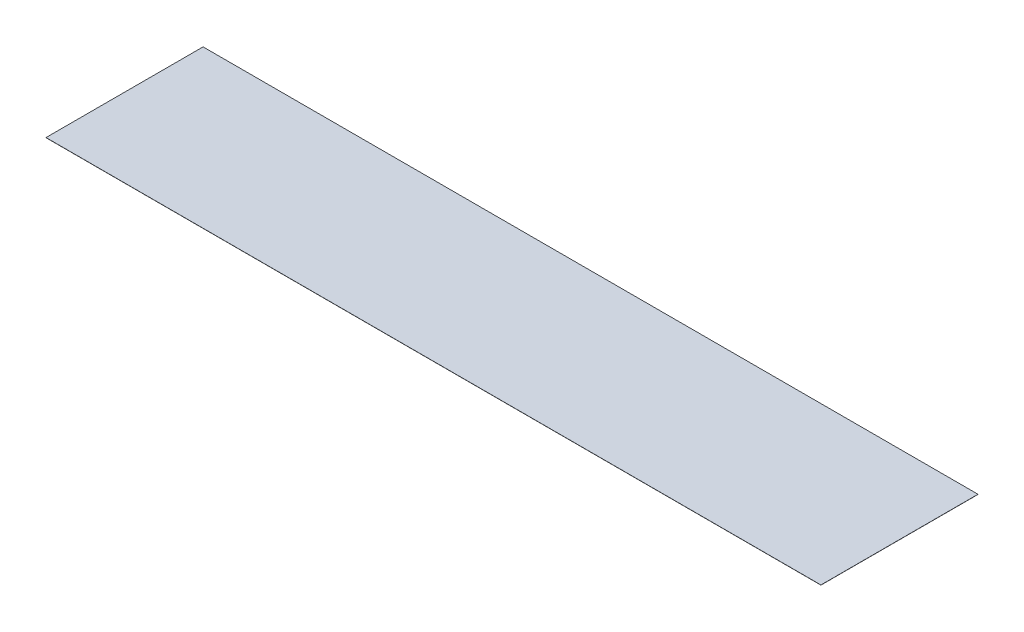
ISO-10303-21;
HEADER;
FILE_DESCRIPTION(('STEP AP214'),'2;1');
FILE_NAME('part.step','',(''),(''),'','','');
FILE_SCHEMA(('AUTOMOTIVE_DESIGN { 1 0 10303 214 1 1 1 1 }'));
ENDSEC;
DATA;
#1=APPLICATION_CONTEXT('core data for automotive mechanical design processes');
#2=APPLICATION_PROTOCOL_DEFINITION('international standard','automotive_design',2000,#1);
#3=PRODUCT_CONTEXT('',#1,'mechanical');
#4=PRODUCT('Part','Part','',(#3));
#5=PRODUCT_RELATED_PRODUCT_CATEGORY('part','',(#4));
#6=PRODUCT_DEFINITION_FORMATION('','',#4);
#7=PRODUCT_DEFINITION_CONTEXT('part definition',#1,'design');
#8=PRODUCT_DEFINITION('design','',#6,#7);
#9=PRODUCT_DEFINITION_SHAPE('','',#8);
#10=(LENGTH_UNIT() NAMED_UNIT(*) SI_UNIT(.MILLI.,.METRE.));
#11=(NAMED_UNIT(*) PLANE_ANGLE_UNIT() SI_UNIT($,.RADIAN.));
#12=(NAMED_UNIT(*) SI_UNIT($,.STERADIAN.) SOLID_ANGLE_UNIT());
#13=UNCERTAINTY_MEASURE_WITH_UNIT(LENGTH_MEASURE(1.E-05),#10,'distance_accuracy_value','');
#14=(GEOMETRIC_REPRESENTATION_CONTEXT(3) GLOBAL_UNCERTAINTY_ASSIGNED_CONTEXT((#13)) GLOBAL_UNIT_ASSIGNED_CONTEXT((#10,
#11,#12)) REPRESENTATION_CONTEXT('',''));
#15=CARTESIAN_POINT('',(0.,0.,0.));
#16=DIRECTION('',(0.,0.,1.));
#17=DIRECTION('',(1.,0.,0.));
#18=AXIS2_PLACEMENT_3D('',#15,#16,#17);
#19=CARTESIAN_POINT('',(0.,4.7752,0.));
#20=DIRECTION('',(1.,0.,0.));
#21=DIRECTION('',(0.,0.,-1.));
#22=AXIS2_PLACEMENT_3D('',#19,#20,#21);
#23=PLANE('',#22);
#24=DIRECTION('',(0.,0.,1.));
#25=VECTOR('',#24,1.);
#26=CARTESIAN_POINT('',(0.,0.,0.));
#27=LINE('',#26,#25);
#28=CARTESIAN_POINT('',(0.,0.,-4572.));
#29=VERTEX_POINT('',#28);
#30=CARTESIAN_POINT('',(0.,0.,0.));
#31=VERTEX_POINT('',#30);
#32=EDGE_CURVE('E101',#29,#31,#27,.T.);
#33=ORIENTED_EDGE('',*,*,#32,.T.);
#34=DIRECTION('',(0.,-1.,0.));
#35=VECTOR('',#34,1.);
#36=CARTESIAN_POINT('',(0.,4.7752,0.));
#37=LINE('',#36,#35);
#38=CARTESIAN_POINT('',(0.,4.7752,0.));
#39=VERTEX_POINT('',#38);
#40=EDGE_CURVE('E11',#39,#31,#37,.T.);
#41=ORIENTED_EDGE('',*,*,#40,.F.);
#42=DIRECTION('',(0.,0.,1.));
#43=VECTOR('',#42,1.);
#44=CARTESIAN_POINT('',(0.,4.7752,0.));
#45=LINE('',#44,#43);
#46=CARTESIAN_POINT('',(0.,4.7752,-4572.));
#47=VERTEX_POINT('',#46);
#48=EDGE_CURVE('E87',#47,#39,#45,.T.);
#49=ORIENTED_EDGE('',*,*,#48,.F.);
#50=DIRECTION('',(0.,-1.,0.));
#51=VECTOR('',#50,1.);
#52=CARTESIAN_POINT('',(0.,4.7752,-4572.));
#53=LINE('',#52,#51);
#54=EDGE_CURVE('E97',#47,#29,#53,.T.);
#55=ORIENTED_EDGE('',*,*,#54,.T.);
#56=EDGE_LOOP('',(#33,#41,#49,#55));
#57=FACE_BOUND('',#56,.T.);
#58=ADVANCED_FACE('F36',(#57),#23,.F.);
#59=CARTESIAN_POINT('',(0.,4.7752,0.));
#60=DIRECTION('',(0.,0.,-1.));
#61=DIRECTION('',(-1.,0.,0.));
#62=AXIS2_PLACEMENT_3D('',#59,#60,#61);
#63=PLANE('',#62);
#64=DIRECTION('',(1.,0.,0.));
#65=VECTOR('',#64,1.);
#66=CARTESIAN_POINT('',(0.,0.,0.));
#67=LINE('',#66,#65);
#68=CARTESIAN_POINT('',(22555.2,0.,0.));
#69=VERTEX_POINT('',#68);
#70=EDGE_CURVE('E92',#31,#69,#67,.T.);
#71=ORIENTED_EDGE('',*,*,#70,.T.);
#72=DIRECTION('',(0.,-1.,0.));
#73=VECTOR('',#72,1.);
#74=CARTESIAN_POINT('',(22555.2,4.7752,0.));
#75=LINE('',#74,#73);
#76=CARTESIAN_POINT('',(22555.2,4.7752,0.));
#77=VERTEX_POINT('',#76);
#78=EDGE_CURVE('E44',#77,#69,#75,.T.);
#79=ORIENTED_EDGE('',*,*,#78,.F.);
#80=DIRECTION('',(1.,0.,0.));
#81=VECTOR('',#80,1.);
#82=CARTESIAN_POINT('',(0.,4.7752,0.));
#83=LINE('',#82,#81);
#84=EDGE_CURVE('E82',#39,#77,#83,.T.);
#85=ORIENTED_EDGE('',*,*,#84,.F.);
#86=ORIENTED_EDGE('',*,*,#40,.T.);
#87=EDGE_LOOP('',(#71,#79,#85,#86));
#88=FACE_BOUND('',#87,.T.);
#89=ADVANCED_FACE('F91',(#88),#63,.F.);
#90=CARTESIAN_POINT('',(22555.2,4.7752,0.));
#91=DIRECTION('',(-1.,0.,0.));
#92=DIRECTION('',(0.,0.,1.));
#93=AXIS2_PLACEMENT_3D('',#90,#91,#92);
#94=PLANE('',#93);
#95=DIRECTION('',(0.,0.,-1.));
#96=VECTOR('',#95,1.);
#97=CARTESIAN_POINT('',(22555.2,0.,0.));
#98=LINE('',#97,#96);
#99=CARTESIAN_POINT('',(22555.2,0.,-4572.));
#100=VERTEX_POINT('',#99);
#101=EDGE_CURVE('E69',#69,#100,#98,.T.);
#102=ORIENTED_EDGE('',*,*,#101,.T.);
#103=DIRECTION('',(0.,-1.,0.));
#104=VECTOR('',#103,1.);
#105=CARTESIAN_POINT('',(22555.2,4.7752,-4572.));
#106=LINE('',#105,#104);
#107=CARTESIAN_POINT('',(22555.2,4.7752,-4572.));
#108=VERTEX_POINT('',#107);
#109=EDGE_CURVE('E93',#108,#100,#106,.T.);
#110=ORIENTED_EDGE('',*,*,#109,.F.);
#111=DIRECTION('',(0.,0.,-1.));
#112=VECTOR('',#111,1.);
#113=CARTESIAN_POINT('',(22555.2,4.7752,0.));
#114=LINE('',#113,#112);
#115=EDGE_CURVE('E85',#77,#108,#114,.T.);
#116=ORIENTED_EDGE('',*,*,#115,.F.);
#117=ORIENTED_EDGE('',*,*,#78,.T.);
#118=EDGE_LOOP('',(#102,#110,#116,#117));
#119=FACE_BOUND('',#118,.T.);
#120=ADVANCED_FACE('F94',(#119),#94,.F.);
#121=CARTESIAN_POINT('',(0.,4.7752,-4572.));
#122=DIRECTION('',(0.,0.,1.));
#123=DIRECTION('',(1.,0.,0.));
#124=AXIS2_PLACEMENT_3D('',#121,#122,#123);
#125=PLANE('',#124);
#126=DIRECTION('',(-1.,0.,0.));
#127=VECTOR('',#126,1.);
#128=CARTESIAN_POINT('',(0.,0.,-4572.));
#129=LINE('',#128,#127);
#130=EDGE_CURVE('E75',#100,#29,#129,.T.);
#131=ORIENTED_EDGE('',*,*,#130,.T.);
#132=ORIENTED_EDGE('',*,*,#54,.F.);
#133=DIRECTION('',(-1.,0.,0.));
#134=VECTOR('',#133,1.);
#135=CARTESIAN_POINT('',(0.,4.7752,-4572.));
#136=LINE('',#135,#134);
#137=EDGE_CURVE('E52',#108,#47,#136,.T.);
#138=ORIENTED_EDGE('',*,*,#137,.F.);
#139=ORIENTED_EDGE('',*,*,#109,.T.);
#140=EDGE_LOOP('',(#131,#132,#138,#139));
#141=FACE_BOUND('',#140,.T.);
#142=ADVANCED_FACE('F110',(#141),#125,.F.);
#143=CARTESIAN_POINT('',(0.,4.7752,0.));
#144=DIRECTION('',(0.,-1.,0.));
#145=DIRECTION('',(0.,0.,-1.));
#146=AXIS2_PLACEMENT_3D('',#143,#144,#145);
#147=PLANE('',#146);
#148=ORIENTED_EDGE('',*,*,#48,.T.);
#149=ORIENTED_EDGE('',*,*,#84,.T.);
#150=ORIENTED_EDGE('',*,*,#115,.T.);
#151=ORIENTED_EDGE('',*,*,#137,.T.);
#152=EDGE_LOOP('',(#148,#149,#150,#151));
#153=FACE_BOUND('',#152,.T.);
#154=ADVANCED_FACE('F83',(#153),#147,.F.);
#155=CARTESIAN_POINT('',(0.,0.,0.));
#156=DIRECTION('',(0.,-1.,0.));
#157=DIRECTION('',(0.,0.,-1.));
#158=AXIS2_PLACEMENT_3D('',#155,#156,#157);
#159=PLANE('',#158);
#160=ORIENTED_EDGE('',*,*,#32,.F.);
#161=ORIENTED_EDGE('',*,*,#130,.F.);
#162=ORIENTED_EDGE('',*,*,#101,.F.);
#163=ORIENTED_EDGE('',*,*,#70,.F.);
#164=EDGE_LOOP('',(#160,#161,#162,#163));
#165=FACE_BOUND('',#164,.T.);
#166=ADVANCED_FACE('F113',(#165),#159,.T.);
#167=CLOSED_SHELL('',(#58,#89,#120,#142,#154,#166));
#168=MANIFOLD_SOLID_BREP('B2',#167);
#169=ADVANCED_BREP_SHAPE_REPRESENTATION('',(#18,#168),#14);
#170=SHAPE_DEFINITION_REPRESENTATION(#9,#169);
ENDSEC;
END-ISO-10303-21;
